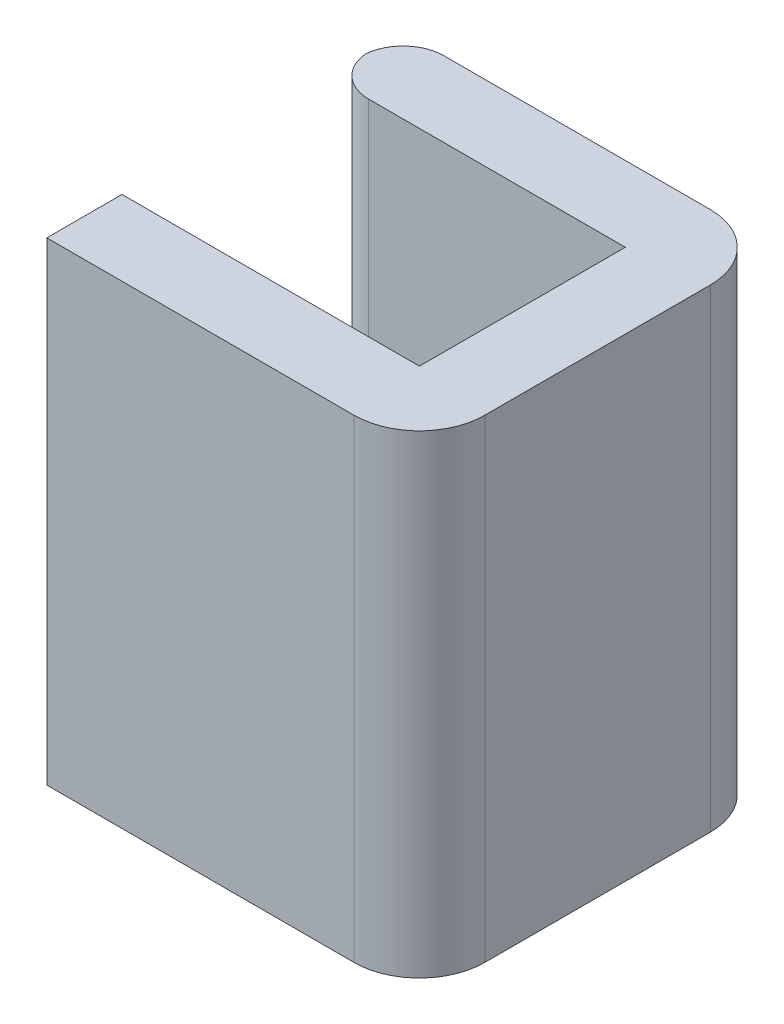
ISO-10303-21;
HEADER;
FILE_DESCRIPTION(('STEP AP214'),'2;1');
FILE_NAME('part.step','',(''),(''),'','','');
FILE_SCHEMA(('AUTOMOTIVE_DESIGN { 1 0 10303 214 1 1 1 1 }'));
ENDSEC;
DATA;
#1=APPLICATION_CONTEXT('core data for automotive mechanical design processes');
#2=APPLICATION_PROTOCOL_DEFINITION('international standard','automotive_design',2000,#1);
#3=PRODUCT_CONTEXT('',#1,'mechanical');
#4=PRODUCT('Part','Part','',(#3));
#5=PRODUCT_RELATED_PRODUCT_CATEGORY('part','',(#4));
#6=PRODUCT_DEFINITION_FORMATION('','',#4);
#7=PRODUCT_DEFINITION_CONTEXT('part definition',#1,'design');
#8=PRODUCT_DEFINITION('design','',#6,#7);
#9=PRODUCT_DEFINITION_SHAPE('','',#8);
#10=(LENGTH_UNIT() NAMED_UNIT(*) SI_UNIT(.MILLI.,.METRE.));
#11=(NAMED_UNIT(*) PLANE_ANGLE_UNIT() SI_UNIT($,.RADIAN.));
#12=(NAMED_UNIT(*) SI_UNIT($,.STERADIAN.) SOLID_ANGLE_UNIT());
#13=UNCERTAINTY_MEASURE_WITH_UNIT(LENGTH_MEASURE(1.E-05),#10,'distance_accuracy_value','');
#14=(GEOMETRIC_REPRESENTATION_CONTEXT(3) GLOBAL_UNCERTAINTY_ASSIGNED_CONTEXT((#13)) GLOBAL_UNIT_ASSIGNED_CONTEXT((#10,
#11,#12)) REPRESENTATION_CONTEXT('',''));
#15=CARTESIAN_POINT('',(0.,0.,0.));
#16=DIRECTION('',(0.,0.,1.));
#17=DIRECTION('',(1.,0.,0.));
#18=AXIS2_PLACEMENT_3D('',#15,#16,#17);
#19=CARTESIAN_POINT('',(1.5825,-0.725,0.125));
#20=DIRECTION('',(0.,1.,0.));
#21=DIRECTION('',(0.,0.,1.));
#22=AXIS2_PLACEMENT_3D('',#19,#20,#21);
#23=CYLINDRICAL_SURFACE('',#22,0.125);
#24=CARTESIAN_POINT('',(1.5825,-0.725,0.125));
#25=DIRECTION('',(0.,1.,0.));
#26=DIRECTION('',(0.,0.,-1.));
#27=AXIS2_PLACEMENT_3D('',#24,#25,#26);
#28=CIRCLE('',#27,0.125);
#29=CARTESIAN_POINT('',(1.5825,-0.725,0.));
#30=VERTEX_POINT('',#29);
#31=CARTESIAN_POINT('',(1.45790064205623,-0.725,0.115));
#32=VERTEX_POINT('',#31);
#33=EDGE_CURVE('E91',#30,#32,#28,.T.);
#34=ORIENTED_EDGE('',*,*,#33,.T.);
#35=DIRECTION('',(0.,-1.,0.));
#36=VECTOR('',#35,1.);
#37=CARTESIAN_POINT('',(1.45790064205623,0.,0.115));
#38=LINE('',#37,#36);
#39=CARTESIAN_POINT('',(1.45790064205623,0.725,0.115));
#40=VERTEX_POINT('',#39);
#41=EDGE_CURVE('E11',#40,#32,#38,.T.);
#42=ORIENTED_EDGE('',*,*,#41,.F.);
#43=CARTESIAN_POINT('',(1.5825,0.725,0.125));
#44=DIRECTION('',(0.,-1.,0.));
#45=DIRECTION('',(0.,0.,-1.));
#46=AXIS2_PLACEMENT_3D('',#43,#44,#45);
#47=CIRCLE('',#46,0.125);
#48=CARTESIAN_POINT('',(1.5825,0.725,0.));
#49=VERTEX_POINT('',#48);
#50=EDGE_CURVE('E28',#40,#49,#47,.T.);
#51=ORIENTED_EDGE('',*,*,#50,.T.);
#52=DIRECTION('',(0.,-1.,0.));
#53=VECTOR('',#52,1.);
#54=CARTESIAN_POINT('',(1.5825,-0.725,0.));
#55=LINE('',#54,#53);
#56=EDGE_CURVE('E170',#49,#30,#55,.T.);
#57=ORIENTED_EDGE('',*,*,#56,.T.);
#58=EDGE_LOOP('',(#34,#42,#51,#57));
#59=FACE_BOUND('',#58,.T.);
#60=ADVANCED_FACE('F17',(#59),#23,.T.);
#61=CARTESIAN_POINT('',(1.5825,-0.725,0.105));
#62=DIRECTION('',(0.,1.,0.));
#63=DIRECTION('',(0.,0.,1.));
#64=AXIS2_PLACEMENT_3D('',#61,#62,#63);
#65=CYLINDRICAL_SURFACE('',#64,0.125);
#66=DIRECTION('',(0.,1.,0.));
#67=VECTOR('',#66,1.);
#68=CARTESIAN_POINT('',(1.5825,-0.725,0.23));
#69=LINE('',#68,#67);
#70=CARTESIAN_POINT('',(1.5825,-0.725,0.23));
#71=VERTEX_POINT('',#70);
#72=CARTESIAN_POINT('',(1.5825,0.725,0.23));
#73=VERTEX_POINT('',#72);
#74=EDGE_CURVE('E206',#71,#73,#69,.T.);
#75=ORIENTED_EDGE('',*,*,#74,.T.);
#76=CARTESIAN_POINT('',(1.5825,0.725,0.105));
#77=DIRECTION('',(0.,-1.,0.));
#78=DIRECTION('',(0.,0.,-1.));
#79=AXIS2_PLACEMENT_3D('',#76,#77,#78);
#80=CIRCLE('',#79,0.125);
#81=EDGE_CURVE('E214',#73,#40,#80,.T.);
#82=ORIENTED_EDGE('',*,*,#81,.T.);
#83=ORIENTED_EDGE('',*,*,#41,.T.);
#84=CARTESIAN_POINT('',(1.5825,-0.725,0.105));
#85=DIRECTION('',(0.,1.,0.));
#86=DIRECTION('',(0.,0.,-1.));
#87=AXIS2_PLACEMENT_3D('',#84,#85,#86);
#88=CIRCLE('',#87,0.125);
#89=EDGE_CURVE('E151',#32,#71,#88,.T.);
#90=ORIENTED_EDGE('',*,*,#89,.T.);
#91=EDGE_LOOP('',(#75,#82,#83,#90));
#92=FACE_BOUND('',#91,.T.);
#93=ADVANCED_FACE('F259',(#92),#65,.T.);
#94=CARTESIAN_POINT('',(2.3975,-0.725,0.89));
#95=DIRECTION('',(0.,1.,0.));
#96=DIRECTION('',(0.,0.,1.));
#97=AXIS2_PLACEMENT_3D('',#94,#95,#96);
#98=CYLINDRICAL_SURFACE('',#97,0.2);
#99=CARTESIAN_POINT('',(2.3975,-0.725,0.89));
#100=DIRECTION('',(0.,1.,0.));
#101=DIRECTION('',(0.,0.,-1.));
#102=AXIS2_PLACEMENT_3D('',#99,#100,#101);
#103=CIRCLE('',#102,0.2);
#104=CARTESIAN_POINT('',(2.3975,-0.725,1.09));
#105=VERTEX_POINT('',#104);
#106=CARTESIAN_POINT('',(2.5975,-0.725,0.89));
#107=VERTEX_POINT('',#106);
#108=EDGE_CURVE('E112',#105,#107,#103,.T.);
#109=ORIENTED_EDGE('',*,*,#108,.T.);
#110=DIRECTION('',(0.,1.,0.));
#111=VECTOR('',#110,1.);
#112=CARTESIAN_POINT('',(2.5975,-0.725,0.89));
#113=LINE('',#112,#111);
#114=CARTESIAN_POINT('',(2.5975,0.725,0.89));
#115=VERTEX_POINT('',#114);
#116=EDGE_CURVE('E146',#107,#115,#113,.T.);
#117=ORIENTED_EDGE('',*,*,#116,.T.);
#118=CARTESIAN_POINT('',(2.3975,0.725,0.89));
#119=DIRECTION('',(0.,-1.,0.));
#120=DIRECTION('',(0.,0.,-1.));
#121=AXIS2_PLACEMENT_3D('',#118,#119,#120);
#122=CIRCLE('',#121,0.2);
#123=CARTESIAN_POINT('',(2.3975,0.725,1.09));
#124=VERTEX_POINT('',#123);
#125=EDGE_CURVE('E123',#115,#124,#122,.T.);
#126=ORIENTED_EDGE('',*,*,#125,.T.);
#127=DIRECTION('',(0.,-1.,0.));
#128=VECTOR('',#127,1.);
#129=CARTESIAN_POINT('',(2.3975,-0.725,1.09));
#130=LINE('',#129,#128);
#131=EDGE_CURVE('E148',#124,#105,#130,.T.);
#132=ORIENTED_EDGE('',*,*,#131,.T.);
#133=EDGE_LOOP('',(#109,#117,#126,#132));
#134=FACE_BOUND('',#133,.T.);
#135=ADVANCED_FACE('F144',(#134),#98,.T.);
#136=CARTESIAN_POINT('',(2.3975,-0.725,0.2));
#137=DIRECTION('',(0.,1.,0.));
#138=DIRECTION('',(0.,0.,1.));
#139=AXIS2_PLACEMENT_3D('',#136,#137,#138);
#140=CYLINDRICAL_SURFACE('',#139,0.2);
#141=CARTESIAN_POINT('',(2.3975,-0.725,0.2));
#142=DIRECTION('',(0.,1.,0.));
#143=DIRECTION('',(0.,0.,-1.));
#144=AXIS2_PLACEMENT_3D('',#141,#142,#143);
#145=CIRCLE('',#144,0.2);
#146=CARTESIAN_POINT('',(2.5975,-0.725,0.2));
#147=VERTEX_POINT('',#146);
#148=CARTESIAN_POINT('',(2.3975,-0.725,0.));
#149=VERTEX_POINT('',#148);
#150=EDGE_CURVE('E152',#147,#149,#145,.T.);
#151=ORIENTED_EDGE('',*,*,#150,.T.);
#152=DIRECTION('',(0.,1.,0.));
#153=VECTOR('',#152,1.);
#154=CARTESIAN_POINT('',(2.3975,-0.725,0.));
#155=LINE('',#154,#153);
#156=CARTESIAN_POINT('',(2.3975,0.725,0.));
#157=VERTEX_POINT('',#156);
#158=EDGE_CURVE('E236',#149,#157,#155,.T.);
#159=ORIENTED_EDGE('',*,*,#158,.T.);
#160=CARTESIAN_POINT('',(2.3975,0.725,0.2));
#161=DIRECTION('',(0.,-1.,0.));
#162=DIRECTION('',(0.,0.,-1.));
#163=AXIS2_PLACEMENT_3D('',#160,#161,#162);
#164=CIRCLE('',#163,0.2);
#165=CARTESIAN_POINT('',(2.5975,0.725,0.2));
#166=VERTEX_POINT('',#165);
#167=EDGE_CURVE('E65',#157,#166,#164,.T.);
#168=ORIENTED_EDGE('',*,*,#167,.T.);
#169=DIRECTION('',(0.,-1.,0.));
#170=VECTOR('',#169,1.);
#171=CARTESIAN_POINT('',(2.5975,-0.725,0.2));
#172=LINE('',#171,#170);
#173=EDGE_CURVE('E160',#166,#147,#172,.T.);
#174=ORIENTED_EDGE('',*,*,#173,.T.);
#175=EDGE_LOOP('',(#151,#159,#168,#174));
#176=FACE_BOUND('',#175,.T.);
#177=ADVANCED_FACE('F326',(#176),#140,.T.);
#178=CARTESIAN_POINT('',(2.0275,0.725,0.545));
#179=DIRECTION('',(0.,-1.,0.));
#180=DIRECTION('',(0.,0.,-1.));
#181=AXIS2_PLACEMENT_3D('',#178,#179,#180);
#182=PLANE('',#181);
#183=ORIENTED_EDGE('',*,*,#81,.F.);
#184=DIRECTION('',(-1.,0.,0.));
#185=VECTOR('',#184,1.);
#186=CARTESIAN_POINT('',(1.9125,0.725,0.23));
#187=LINE('',#186,#185);
#188=CARTESIAN_POINT('',(2.3675,0.725,0.23));
#189=VERTEX_POINT('',#188);
#190=EDGE_CURVE('E210',#189,#73,#187,.T.);
#191=ORIENTED_EDGE('',*,*,#190,.F.);
#192=DIRECTION('',(0.,0.,-1.));
#193=VECTOR('',#192,1.);
#194=CARTESIAN_POINT('',(2.3675,0.725,0.545));
#195=LINE('',#194,#193);
#196=CARTESIAN_POINT('',(2.3675,0.725,0.86));
#197=VERTEX_POINT('',#196);
#198=EDGE_CURVE('E200',#197,#189,#195,.T.);
#199=ORIENTED_EDGE('',*,*,#198,.F.);
#200=DIRECTION('',(1.,0.,0.));
#201=VECTOR('',#200,1.);
#202=CARTESIAN_POINT('',(1.9125,0.725,0.86));
#203=LINE('',#202,#201);
#204=CARTESIAN_POINT('',(1.4575,0.725,0.86));
#205=VERTEX_POINT('',#204);
#206=EDGE_CURVE('E181',#205,#197,#203,.T.);
#207=ORIENTED_EDGE('',*,*,#206,.F.);
#208=DIRECTION('',(0.,0.,-1.));
#209=VECTOR('',#208,1.);
#210=CARTESIAN_POINT('',(1.4575,0.725,0.975));
#211=LINE('',#210,#209);
#212=CARTESIAN_POINT('',(1.4575,0.725,1.09));
#213=VERTEX_POINT('',#212);
#214=EDGE_CURVE('E203',#213,#205,#211,.T.);
#215=ORIENTED_EDGE('',*,*,#214,.F.);
#216=DIRECTION('',(-1.,0.,0.));
#217=VECTOR('',#216,1.);
#218=CARTESIAN_POINT('',(2.0275,0.725,1.09));
#219=LINE('',#218,#217);
#220=EDGE_CURVE('E194',#124,#213,#219,.T.);
#221=ORIENTED_EDGE('',*,*,#220,.F.);
#222=ORIENTED_EDGE('',*,*,#125,.F.);
#223=DIRECTION('',(0.,0.,1.));
#224=VECTOR('',#223,1.);
#225=CARTESIAN_POINT('',(2.5975,0.725,0.545));
#226=LINE('',#225,#224);
#227=EDGE_CURVE('E163',#166,#115,#226,.T.);
#228=ORIENTED_EDGE('',*,*,#227,.F.);
#229=ORIENTED_EDGE('',*,*,#167,.F.);
#230=DIRECTION('',(1.,0.,0.));
#231=VECTOR('',#230,1.);
#232=CARTESIAN_POINT('',(2.0275,0.725,0.));
#233=LINE('',#232,#231);
#234=EDGE_CURVE('E239',#49,#157,#233,.T.);
#235=ORIENTED_EDGE('',*,*,#234,.F.);
#236=ORIENTED_EDGE('',*,*,#50,.F.);
#237=EDGE_LOOP('',(#183,#191,#199,#207,#215,#221,#222,#228,#229,#235,#236));
#238=FACE_BOUND('',#237,.T.);
#239=ADVANCED_FACE('F265',(#238),#182,.F.);
#240=CARTESIAN_POINT('',(2.0275,-0.725,0.545));
#241=DIRECTION('',(0.,-1.,0.));
#242=DIRECTION('',(0.,0.,-1.));
#243=AXIS2_PLACEMENT_3D('',#240,#241,#242);
#244=PLANE('',#243);
#245=DIRECTION('',(1.,0.,0.));
#246=VECTOR('',#245,1.);
#247=CARTESIAN_POINT('',(2.0275,-0.725,0.));
#248=LINE('',#247,#246);
#249=EDGE_CURVE('E233',#30,#149,#248,.T.);
#250=ORIENTED_EDGE('',*,*,#249,.T.);
#251=ORIENTED_EDGE('',*,*,#150,.F.);
#252=DIRECTION('',(0.,0.,1.));
#253=VECTOR('',#252,1.);
#254=CARTESIAN_POINT('',(2.5975,-0.725,0.545));
#255=LINE('',#254,#253);
#256=EDGE_CURVE('E155',#147,#107,#255,.T.);
#257=ORIENTED_EDGE('',*,*,#256,.T.);
#258=ORIENTED_EDGE('',*,*,#108,.F.);
#259=DIRECTION('',(-1.,0.,0.));
#260=VECTOR('',#259,1.);
#261=CARTESIAN_POINT('',(2.0275,-0.725,1.09));
#262=LINE('',#261,#260);
#263=CARTESIAN_POINT('',(1.4575,-0.725,1.09));
#264=VERTEX_POINT('',#263);
#265=EDGE_CURVE('E192',#105,#264,#262,.T.);
#266=ORIENTED_EDGE('',*,*,#265,.T.);
#267=DIRECTION('',(0.,0.,-1.));
#268=VECTOR('',#267,1.);
#269=CARTESIAN_POINT('',(1.4575,-0.725,0.975));
#270=LINE('',#269,#268);
#271=CARTESIAN_POINT('',(1.4575,-0.725,0.86));
#272=VERTEX_POINT('',#271);
#273=EDGE_CURVE('E185',#264,#272,#270,.T.);
#274=ORIENTED_EDGE('',*,*,#273,.T.);
#275=DIRECTION('',(1.,0.,0.));
#276=VECTOR('',#275,1.);
#277=CARTESIAN_POINT('',(1.9125,-0.725,0.86));
#278=LINE('',#277,#276);
#279=CARTESIAN_POINT('',(2.3675,-0.725,0.86));
#280=VERTEX_POINT('',#279);
#281=EDGE_CURVE('E182',#272,#280,#278,.T.);
#282=ORIENTED_EDGE('',*,*,#281,.T.);
#283=DIRECTION('',(0.,0.,-1.));
#284=VECTOR('',#283,1.);
#285=CARTESIAN_POINT('',(2.3675,-0.725,0.545));
#286=LINE('',#285,#284);
#287=CARTESIAN_POINT('',(2.3675,-0.725,0.23));
#288=VERTEX_POINT('',#287);
#289=EDGE_CURVE('E100',#280,#288,#286,.T.);
#290=ORIENTED_EDGE('',*,*,#289,.T.);
#291=DIRECTION('',(-1.,0.,0.));
#292=VECTOR('',#291,1.);
#293=CARTESIAN_POINT('',(1.9125,-0.725,0.23));
#294=LINE('',#293,#292);
#295=EDGE_CURVE('E173',#288,#71,#294,.T.);
#296=ORIENTED_EDGE('',*,*,#295,.T.);
#297=ORIENTED_EDGE('',*,*,#89,.F.);
#298=ORIENTED_EDGE('',*,*,#33,.F.);
#299=EDGE_LOOP('',(#250,#251,#257,#258,#266,#274,#282,#290,#296,#297,#298));
#300=FACE_BOUND('',#299,.T.);
#301=ADVANCED_FACE('F19',(#300),#244,.T.);
#302=CARTESIAN_POINT('',(2.5975,-0.725,0.545));
#303=DIRECTION('',(1.,0.,0.));
#304=DIRECTION('',(0.,0.,-1.));
#305=AXIS2_PLACEMENT_3D('',#302,#303,#304);
#306=PLANE('',#305);
#307=ORIENTED_EDGE('',*,*,#227,.T.);
#308=ORIENTED_EDGE('',*,*,#116,.F.);
#309=ORIENTED_EDGE('',*,*,#256,.F.);
#310=ORIENTED_EDGE('',*,*,#173,.F.);
#311=EDGE_LOOP('',(#307,#308,#309,#310));
#312=FACE_BOUND('',#311,.T.);
#313=ADVANCED_FACE('F162',(#312),#306,.T.);
#314=CARTESIAN_POINT('',(2.0275,-0.725,1.09));
#315=DIRECTION('',(0.,0.,1.));
#316=DIRECTION('',(1.,0.,0.));
#317=AXIS2_PLACEMENT_3D('',#314,#315,#316);
#318=PLANE('',#317);
#319=ORIENTED_EDGE('',*,*,#220,.T.);
#320=DIRECTION('',(0.,1.,0.));
#321=VECTOR('',#320,1.);
#322=CARTESIAN_POINT('',(1.4575,-0.725,1.09));
#323=LINE('',#322,#321);
#324=EDGE_CURVE('E189',#264,#213,#323,.T.);
#325=ORIENTED_EDGE('',*,*,#324,.F.);
#326=ORIENTED_EDGE('',*,*,#265,.F.);
#327=ORIENTED_EDGE('',*,*,#131,.F.);
#328=EDGE_LOOP('',(#319,#325,#326,#327));
#329=FACE_BOUND('',#328,.T.);
#330=ADVANCED_FACE('F315',(#329),#318,.T.);
#331=CARTESIAN_POINT('',(1.4575,-0.725,0.975));
#332=DIRECTION('',(-1.,0.,0.));
#333=DIRECTION('',(0.,0.,1.));
#334=AXIS2_PLACEMENT_3D('',#331,#332,#333);
#335=PLANE('',#334);
#336=DIRECTION('',(0.,1.,0.));
#337=VECTOR('',#336,1.);
#338=CARTESIAN_POINT('',(1.4575,-0.725,0.86));
#339=LINE('',#338,#337);
#340=EDGE_CURVE('E177',#272,#205,#339,.T.);
#341=ORIENTED_EDGE('',*,*,#340,.F.);
#342=ORIENTED_EDGE('',*,*,#273,.F.);
#343=ORIENTED_EDGE('',*,*,#324,.T.);
#344=ORIENTED_EDGE('',*,*,#214,.T.);
#345=EDGE_LOOP('',(#341,#342,#343,#344));
#346=FACE_BOUND('',#345,.T.);
#347=ADVANCED_FACE('F306',(#346),#335,.T.);
#348=CARTESIAN_POINT('',(1.9125,-0.725,0.86));
#349=DIRECTION('',(0.,0.,-1.));
#350=DIRECTION('',(-1.,0.,0.));
#351=AXIS2_PLACEMENT_3D('',#348,#349,#350);
#352=PLANE('',#351);
#353=DIRECTION('',(0.,1.,0.));
#354=VECTOR('',#353,1.);
#355=CARTESIAN_POINT('',(2.3675,-0.725,0.86));
#356=LINE('',#355,#354);
#357=EDGE_CURVE('E21',#280,#197,#356,.T.);
#358=ORIENTED_EDGE('',*,*,#357,.F.);
#359=ORIENTED_EDGE('',*,*,#281,.F.);
#360=ORIENTED_EDGE('',*,*,#340,.T.);
#361=ORIENTED_EDGE('',*,*,#206,.T.);
#362=EDGE_LOOP('',(#358,#359,#360,#361));
#363=FACE_BOUND('',#362,.T.);
#364=ADVANCED_FACE('F301',(#363),#352,.T.);
#365=CARTESIAN_POINT('',(2.3675,-0.725,0.545));
#366=DIRECTION('',(-1.,0.,0.));
#367=DIRECTION('',(0.,0.,1.));
#368=AXIS2_PLACEMENT_3D('',#365,#366,#367);
#369=PLANE('',#368);
#370=DIRECTION('',(0.,1.,0.));
#371=VECTOR('',#370,1.);
#372=CARTESIAN_POINT('',(2.3675,-0.725,0.23));
#373=LINE('',#372,#371);
#374=EDGE_CURVE('E176',#288,#189,#373,.T.);
#375=ORIENTED_EDGE('',*,*,#374,.F.);
#376=ORIENTED_EDGE('',*,*,#289,.F.);
#377=ORIENTED_EDGE('',*,*,#357,.T.);
#378=ORIENTED_EDGE('',*,*,#198,.T.);
#379=EDGE_LOOP('',(#375,#376,#377,#378));
#380=FACE_BOUND('',#379,.T.);
#381=ADVANCED_FACE('F271',(#380),#369,.T.);
#382=CARTESIAN_POINT('',(1.9125,-0.725,0.23));
#383=DIRECTION('',(0.,0.,1.));
#384=DIRECTION('',(1.,0.,0.));
#385=AXIS2_PLACEMENT_3D('',#382,#383,#384);
#386=PLANE('',#385);
#387=ORIENTED_EDGE('',*,*,#295,.F.);
#388=ORIENTED_EDGE('',*,*,#374,.T.);
#389=ORIENTED_EDGE('',*,*,#190,.T.);
#390=ORIENTED_EDGE('',*,*,#74,.F.);
#391=EDGE_LOOP('',(#387,#388,#389,#390));
#392=FACE_BOUND('',#391,.T.);
#393=ADVANCED_FACE('F261',(#392),#386,.T.);
#394=CARTESIAN_POINT('',(2.0275,-0.725,0.));
#395=DIRECTION('',(0.,0.,-1.));
#396=DIRECTION('',(0.,-1.,0.));
#397=AXIS2_PLACEMENT_3D('',#394,#395,#396);
#398=PLANE('',#397);
#399=ORIENTED_EDGE('',*,*,#234,.T.);
#400=ORIENTED_EDGE('',*,*,#158,.F.);
#401=ORIENTED_EDGE('',*,*,#249,.F.);
#402=ORIENTED_EDGE('',*,*,#56,.F.);
#403=EDGE_LOOP('',(#399,#400,#401,#402));
#404=FACE_BOUND('',#403,.T.);
#405=ADVANCED_FACE('F294',(#404),#398,.T.);
#406=CLOSED_SHELL('',(#60,#93,#135,#177,#239,#301,#313,#330,#347,#364,#381,#393,#405));
#407=MANIFOLD_SOLID_BREP('B1',#406);
#408=ADVANCED_BREP_SHAPE_REPRESENTATION('',(#18,#407),#14);
#409=SHAPE_DEFINITION_REPRESENTATION(#9,#408);
ENDSEC;
END-ISO-10303-21;
